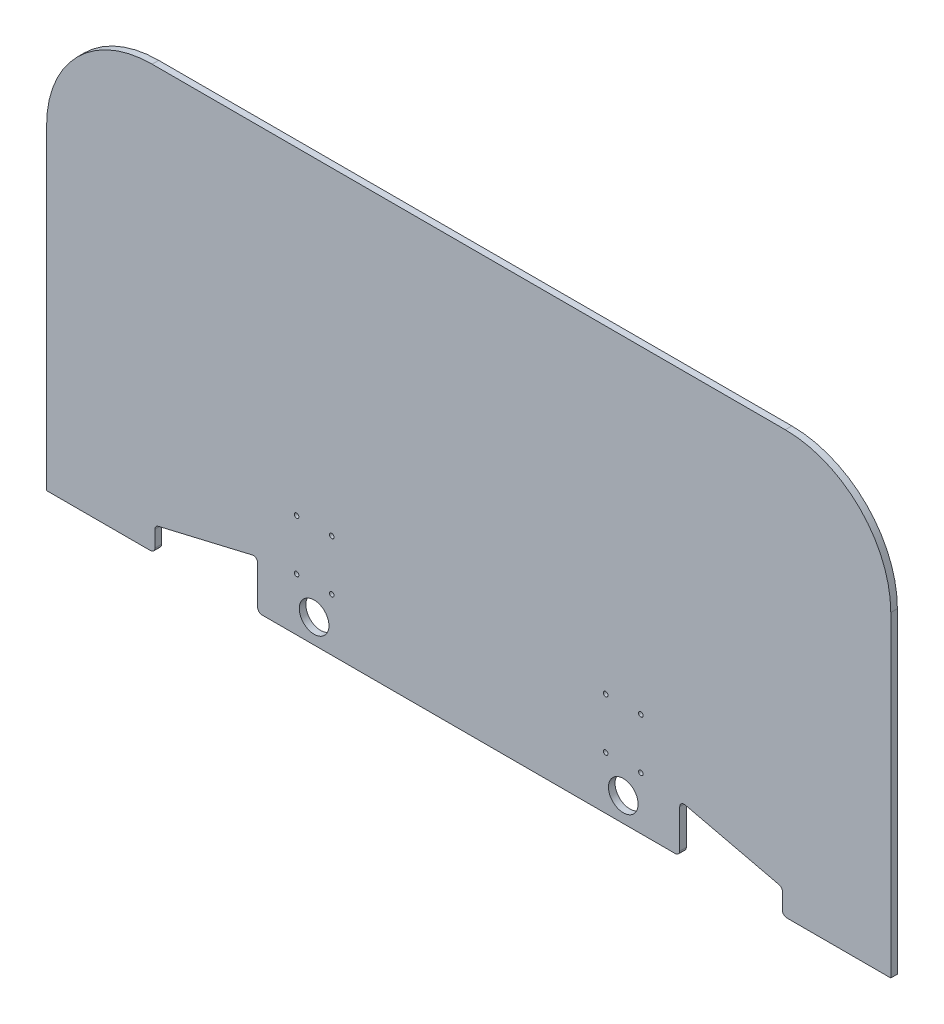
ISO-10303-21;
HEADER;
FILE_DESCRIPTION(('STEP AP214'),'2;1');
FILE_NAME('part.step','',(''),(''),'','','');
FILE_SCHEMA(('AUTOMOTIVE_DESIGN { 1 0 10303 214 1 1 1 1 }'));
ENDSEC;
DATA;
#1=APPLICATION_CONTEXT('core data for automotive mechanical design processes');
#2=APPLICATION_PROTOCOL_DEFINITION('international standard','automotive_design',2000,#1);
#3=PRODUCT_CONTEXT('',#1,'mechanical');
#4=PRODUCT('Part','Part','',(#3));
#5=PRODUCT_RELATED_PRODUCT_CATEGORY('part','',(#4));
#6=PRODUCT_DEFINITION_FORMATION('','',#4);
#7=PRODUCT_DEFINITION_CONTEXT('part definition',#1,'design');
#8=PRODUCT_DEFINITION('design','',#6,#7);
#9=PRODUCT_DEFINITION_SHAPE('','',#8);
#10=(LENGTH_UNIT() NAMED_UNIT(*) SI_UNIT(.MILLI.,.METRE.));
#11=(NAMED_UNIT(*) PLANE_ANGLE_UNIT() SI_UNIT($,.RADIAN.));
#12=(NAMED_UNIT(*) SI_UNIT($,.STERADIAN.) SOLID_ANGLE_UNIT());
#13=UNCERTAINTY_MEASURE_WITH_UNIT(LENGTH_MEASURE(1.E-05),#10,'distance_accuracy_value','');
#14=(GEOMETRIC_REPRESENTATION_CONTEXT(3) GLOBAL_UNCERTAINTY_ASSIGNED_CONTEXT((#13)) GLOBAL_UNIT_ASSIGNED_CONTEXT((#10,
#11,#12)) REPRESENTATION_CONTEXT('',''));
#15=CARTESIAN_POINT('',(0.,0.,0.));
#16=DIRECTION('',(0.,0.,1.));
#17=DIRECTION('',(1.,0.,0.));
#18=AXIS2_PLACEMENT_3D('',#15,#16,#17);
#19=CARTESIAN_POINT('',(0.,0.,4.7625));
#20=DIRECTION('',(0.,0.,1.));
#21=DIRECTION('',(1.,0.,0.));
#22=AXIS2_PLACEMENT_3D('',#19,#20,#21);
#23=PLANE('',#22);
#24=CARTESIAN_POINT('',(197.79996,-155.575,4.7625));
#25=DIRECTION('',(0.,0.,1.));
#26=DIRECTION('',(1.,0.,0.));
#27=AXIS2_PLACEMENT_3D('',#24,#25,#26);
#28=CIRCLE('',#27,3.302);
#29=CARTESIAN_POINT('',(201.10196,-155.575,4.7625));
#30=VERTEX_POINT('',#29);
#31=EDGE_CURVE('E378',#30,#30,#28,.F.);
#32=ORIENTED_EDGE('',*,*,#31,.T.);
#33=EDGE_LOOP('',(#32));
#34=FACE_BOUND('',#33,.T.);
#35=CARTESIAN_POINT('',(248.59996,-155.575,4.7625));
#36=DIRECTION('',(0.,0.,1.));
#37=DIRECTION('',(1.,0.,0.));
#38=AXIS2_PLACEMENT_3D('',#35,#36,#37);
#39=CIRCLE('',#38,3.302);
#40=CARTESIAN_POINT('',(251.90196,-155.575,4.7625));
#41=VERTEX_POINT('',#40);
#42=EDGE_CURVE('E381',#41,#41,#39,.F.);
#43=ORIENTED_EDGE('',*,*,#42,.T.);
#44=EDGE_LOOP('',(#43));
#45=FACE_BOUND('',#44,.T.);
#46=CARTESIAN_POINT('',(197.79996,-228.6,4.7625));
#47=DIRECTION('',(0.,0.,1.));
#48=DIRECTION('',(1.,0.,0.));
#49=AXIS2_PLACEMENT_3D('',#46,#47,#48);
#50=CIRCLE('',#49,3.302);
#51=CARTESIAN_POINT('',(201.10196,-228.6,4.7625));
#52=VERTEX_POINT('',#51);
#53=EDGE_CURVE('E384',#52,#52,#50,.F.);
#54=ORIENTED_EDGE('',*,*,#53,.T.);
#55=EDGE_LOOP('',(#54));
#56=FACE_BOUND('',#55,.T.);
#57=CARTESIAN_POINT('',(248.59996,-228.6,4.7625));
#58=DIRECTION('',(0.,0.,1.));
#59=DIRECTION('',(1.,0.,0.));
#60=AXIS2_PLACEMENT_3D('',#57,#58,#59);
#61=CIRCLE('',#60,3.302);
#62=CARTESIAN_POINT('',(251.90196,-228.6,4.7625));
#63=VERTEX_POINT('',#62);
#64=EDGE_CURVE('E387',#63,#63,#61,.F.);
#65=ORIENTED_EDGE('',*,*,#64,.T.);
#66=EDGE_LOOP('',(#65));
#67=FACE_BOUND('',#66,.T.);
#68=CARTESIAN_POINT('',(-197.79996,-155.575,4.7625));
#69=DIRECTION('',(0.,0.,-1.));
#70=DIRECTION('',(-1.,0.,0.));
#71=AXIS2_PLACEMENT_3D('',#68,#69,#70);
#72=CIRCLE('',#71,3.302);
#73=CARTESIAN_POINT('',(-201.10196,-155.575,4.7625));
#74=VERTEX_POINT('',#73);
#75=EDGE_CURVE('E390',#74,#74,#72,.T.);
#76=ORIENTED_EDGE('',*,*,#75,.T.);
#77=EDGE_LOOP('',(#76));
#78=FACE_BOUND('',#77,.T.);
#79=CARTESIAN_POINT('',(-248.59996,-155.575,4.7625));
#80=DIRECTION('',(0.,0.,-1.));
#81=DIRECTION('',(-1.,0.,0.));
#82=AXIS2_PLACEMENT_3D('',#79,#80,#81);
#83=CIRCLE('',#82,3.302);
#84=CARTESIAN_POINT('',(-251.90196,-155.575,4.7625));
#85=VERTEX_POINT('',#84);
#86=EDGE_CURVE('E393',#85,#85,#83,.T.);
#87=ORIENTED_EDGE('',*,*,#86,.T.);
#88=EDGE_LOOP('',(#87));
#89=FACE_BOUND('',#88,.T.);
#90=CARTESIAN_POINT('',(-197.79996,-228.6,4.7625));
#91=DIRECTION('',(0.,0.,-1.));
#92=DIRECTION('',(-1.,0.,0.));
#93=AXIS2_PLACEMENT_3D('',#90,#91,#92);
#94=CIRCLE('',#93,3.302);
#95=CARTESIAN_POINT('',(-201.10196,-228.6,4.7625));
#96=VERTEX_POINT('',#95);
#97=EDGE_CURVE('E396',#96,#96,#94,.T.);
#98=ORIENTED_EDGE('',*,*,#97,.T.);
#99=EDGE_LOOP('',(#98));
#100=FACE_BOUND('',#99,.T.);
#101=CARTESIAN_POINT('',(-248.59996,-228.6,4.7625));
#102=DIRECTION('',(0.,0.,-1.));
#103=DIRECTION('',(-1.,0.,0.));
#104=AXIS2_PLACEMENT_3D('',#101,#102,#103);
#105=CIRCLE('',#104,3.302);
#106=CARTESIAN_POINT('',(-251.90196,-228.6,4.7625));
#107=VERTEX_POINT('',#106);
#108=EDGE_CURVE('E399',#107,#107,#105,.T.);
#109=ORIENTED_EDGE('',*,*,#108,.T.);
#110=EDGE_LOOP('',(#109));
#111=FACE_BOUND('',#110,.T.);
#112=CARTESIAN_POINT('',(-223.266,-269.875,4.7625));
#113=DIRECTION('',(0.,0.,-1.));
#114=DIRECTION('',(-1.,0.,0.));
#115=AXIS2_PLACEMENT_3D('',#112,#113,#114);
#116=CIRCLE('',#115,21.43125);
#117=CARTESIAN_POINT('',(-244.69725,-269.875,4.7625));
#118=VERTEX_POINT('',#117);
#119=EDGE_CURVE('E402',#118,#118,#116,.T.);
#120=ORIENTED_EDGE('',*,*,#119,.T.);
#121=EDGE_LOOP('',(#120));
#122=FACE_BOUND('',#121,.T.);
#123=CARTESIAN_POINT('',(223.266,-269.875,4.7625));
#124=DIRECTION('',(0.,0.,-1.));
#125=DIRECTION('',(-1.,0.,0.));
#126=AXIS2_PLACEMENT_3D('',#123,#124,#125);
#127=CIRCLE('',#126,21.43125);
#128=CARTESIAN_POINT('',(201.83475,-269.875,4.7625));
#129=VERTEX_POINT('',#128);
#130=EDGE_CURVE('E248',#129,#129,#127,.T.);
#131=ORIENTED_EDGE('',*,*,#130,.T.);
#132=EDGE_LOOP('',(#131));
#133=FACE_BOUND('',#132,.T.);
#134=DIRECTION('',(1.,0.,0.));
#135=VECTOR('',#134,1.);
#136=CARTESIAN_POINT('',(609.6,304.8,4.7625));
#137=LINE('',#136,#135);
#138=CARTESIAN_POINT('',(-457.2,304.8,4.7625));
#139=VERTEX_POINT('',#138);
#140=CARTESIAN_POINT('',(457.2,304.8,4.7625));
#141=VERTEX_POINT('',#140);
#142=EDGE_CURVE('E245',#139,#141,#137,.T.);
#143=ORIENTED_EDGE('',*,*,#142,.F.);
#144=CARTESIAN_POINT('',(-457.2,152.4,4.7625));
#145=DIRECTION('',(0.,0.,-1.));
#146=DIRECTION('',(-1.,0.,0.));
#147=AXIS2_PLACEMENT_3D('',#144,#145,#146);
#148=CIRCLE('',#147,152.4);
#149=CARTESIAN_POINT('',(-609.6,152.4,4.7625));
#150=VERTEX_POINT('',#149);
#151=EDGE_CURVE('E20',#150,#139,#148,.T.);
#152=ORIENTED_EDGE('',*,*,#151,.F.);
#153=DIRECTION('',(0.,1.,0.));
#154=VECTOR('',#153,1.);
#155=CARTESIAN_POINT('',(-609.6,304.8,4.7625));
#156=LINE('',#155,#154);
#157=CARTESIAN_POINT('',(-609.6,-304.8,4.7625));
#158=VERTEX_POINT('',#157);
#159=EDGE_CURVE('E156',#158,#150,#156,.T.);
#160=ORIENTED_EDGE('',*,*,#159,.F.);
#161=DIRECTION('',(1.,0.,0.));
#162=VECTOR('',#161,1.);
#163=CARTESIAN_POINT('',(-609.6,-304.8,4.7625));
#164=LINE('',#163,#162);
#165=CARTESIAN_POINT('',(-459.494209104994,-304.8,4.7625));
#166=VERTEX_POINT('',#165);
#167=EDGE_CURVE('E162',#166,#158,#164,.F.);
#168=ORIENTED_EDGE('',*,*,#167,.F.);
#169=CARTESIAN_POINT('',(-459.494209104994,-298.45,4.7625));
#170=DIRECTION('',(0.,0.,1.));
#171=DIRECTION('',(1.,0.,0.));
#172=AXIS2_PLACEMENT_3D('',#169,#170,#171);
#173=CIRCLE('',#172,6.35);
#174=CARTESIAN_POINT('',(-453.144209104994,-298.45,4.7625));
#175=VERTEX_POINT('',#174);
#176=EDGE_CURVE('E304',#175,#166,#173,.F.);
#177=ORIENTED_EDGE('',*,*,#176,.F.);
#178=DIRECTION('',(0.,1.,0.));
#179=VECTOR('',#178,1.);
#180=CARTESIAN_POINT('',(-453.144209104994,-269.875,4.7625));
#181=LINE('',#180,#179);
#182=CARTESIAN_POINT('',(-453.144209104994,-274.903617257706,4.7625));
#183=VERTEX_POINT('',#182);
#184=EDGE_CURVE('E300',#175,#183,#181,.T.);
#185=ORIENTED_EDGE('',*,*,#184,.T.);
#186=CARTESIAN_POINT('',(-446.794209104994,-274.903617257706,4.7625));
#187=DIRECTION('',(0.,0.,-1.));
#188=DIRECTION('',(-1.,0.,0.));
#189=AXIS2_PLACEMENT_3D('',#186,#187,#188);
#190=CIRCLE('',#189,6.35);
#191=CARTESIAN_POINT('',(-448.249417438357,-268.722608545088,4.7625));
#192=VERTEX_POINT('',#191);
#193=EDGE_CURVE('E296',#183,#192,#190,.T.);
#194=ORIENTED_EDGE('',*,*,#193,.T.);
#195=DIRECTION('',(-0.973387198851966,-0.229166666666692,0.));
#196=VECTOR('',#195,1.);
#197=CARTESIAN_POINT('',(-304.8,-234.95,4.7625));
#198=LINE('',#197,#196);
#199=CARTESIAN_POINT('',(-312.605208333375,-236.787597184874,4.7625));
#200=VERTEX_POINT('',#199);
#201=EDGE_CURVE('E292',#192,#200,#198,.F.);
#202=ORIENTED_EDGE('',*,*,#201,.T.);
#203=CARTESIAN_POINT('',(-311.15,-242.96860589758,4.7625));
#204=DIRECTION('',(0.,0.,-1.));
#205=DIRECTION('',(-1.,0.,0.));
#206=AXIS2_PLACEMENT_3D('',#203,#204,#205);
#207=CIRCLE('',#206,6.35);
#208=CARTESIAN_POINT('',(-304.8,-242.96860589758,4.7625));
#209=VERTEX_POINT('',#208);
#210=EDGE_CURVE('E288',#200,#209,#207,.T.);
#211=ORIENTED_EDGE('',*,*,#210,.T.);
#212=DIRECTION('',(0.,1.,0.));
#213=VECTOR('',#212,1.);
#214=CARTESIAN_POINT('',(-304.8,-304.8,4.7625));
#215=LINE('',#214,#213);
#216=CARTESIAN_POINT('',(-304.8,-298.45,4.7625));
#217=VERTEX_POINT('',#216);
#218=EDGE_CURVE('E287',#209,#217,#215,.F.);
#219=ORIENTED_EDGE('',*,*,#218,.T.);
#220=CARTESIAN_POINT('',(-298.45,-298.45,4.7625));
#221=DIRECTION('',(0.,0.,-1.));
#222=DIRECTION('',(-1.,0.,0.));
#223=AXIS2_PLACEMENT_3D('',#220,#221,#222);
#224=CIRCLE('',#223,6.35);
#225=CARTESIAN_POINT('',(-298.45,-304.8,4.7625));
#226=VERTEX_POINT('',#225);
#227=EDGE_CURVE('E283',#226,#217,#224,.T.);
#228=ORIENTED_EDGE('',*,*,#227,.F.);
#229=DIRECTION('',(1.,0.,0.));
#230=VECTOR('',#229,1.);
#231=CARTESIAN_POINT('',(-609.6,-304.8,4.7625));
#232=LINE('',#231,#230);
#233=CARTESIAN_POINT('',(298.45,-304.8,4.7625));
#234=VERTEX_POINT('',#233);
#235=EDGE_CURVE('E280',#234,#226,#232,.F.);
#236=ORIENTED_EDGE('',*,*,#235,.F.);
#237=CARTESIAN_POINT('',(298.45,-298.45,4.7625));
#238=DIRECTION('',(0.,0.,1.));
#239=DIRECTION('',(1.,0.,0.));
#240=AXIS2_PLACEMENT_3D('',#237,#238,#239);
#241=CIRCLE('',#240,6.35);
#242=CARTESIAN_POINT('',(304.8,-298.45,4.7625));
#243=VERTEX_POINT('',#242);
#244=EDGE_CURVE('E277',#243,#234,#241,.F.);
#245=ORIENTED_EDGE('',*,*,#244,.F.);
#246=DIRECTION('',(0.,1.,0.));
#247=VECTOR('',#246,1.);
#248=CARTESIAN_POINT('',(304.8,-304.8,4.7625));
#249=LINE('',#248,#247);
#250=CARTESIAN_POINT('',(304.8,-242.96860589758,4.7625));
#251=VERTEX_POINT('',#250);
#252=EDGE_CURVE('E274',#251,#243,#249,.F.);
#253=ORIENTED_EDGE('',*,*,#252,.F.);
#254=CARTESIAN_POINT('',(311.15,-242.96860589758,4.7625));
#255=DIRECTION('',(0.,0.,1.));
#256=DIRECTION('',(1.,0.,0.));
#257=AXIS2_PLACEMENT_3D('',#254,#255,#256);
#258=CIRCLE('',#257,6.35);
#259=CARTESIAN_POINT('',(312.605208333376,-236.78759718487,4.7625));
#260=VERTEX_POINT('',#259);
#261=EDGE_CURVE('E271',#251,#260,#258,.F.);
#262=ORIENTED_EDGE('',*,*,#261,.T.);
#263=DIRECTION('',(0.973387198851966,-0.229166666666692,0.));
#264=VECTOR('',#263,1.);
#265=CARTESIAN_POINT('',(304.8,-234.95,4.7625));
#266=LINE('',#265,#264);
#267=CARTESIAN_POINT('',(448.249417438366,-268.722608545048,4.7625));
#268=VERTEX_POINT('',#267);
#269=EDGE_CURVE('E267',#268,#260,#266,.F.);
#270=ORIENTED_EDGE('',*,*,#269,.F.);
#271=CARTESIAN_POINT('',(446.794209104994,-274.903617257706,4.7625));
#272=DIRECTION('',(0.,0.,1.));
#273=DIRECTION('',(1.,0.,0.));
#274=AXIS2_PLACEMENT_3D('',#271,#272,#273);
#275=CIRCLE('',#274,6.35);
#276=CARTESIAN_POINT('',(453.144209104994,-274.903617257706,4.7625));
#277=VERTEX_POINT('',#276);
#278=EDGE_CURVE('E264',#268,#277,#275,.F.);
#279=ORIENTED_EDGE('',*,*,#278,.T.);
#280=DIRECTION('',(0.,1.,0.));
#281=VECTOR('',#280,1.);
#282=CARTESIAN_POINT('',(453.144209104994,-269.875,4.7625));
#283=LINE('',#282,#281);
#284=CARTESIAN_POINT('',(453.144209104994,-298.45,4.7625));
#285=VERTEX_POINT('',#284);
#286=EDGE_CURVE('E260',#285,#277,#283,.T.);
#287=ORIENTED_EDGE('',*,*,#286,.F.);
#288=CARTESIAN_POINT('',(459.494209104994,-298.45,4.7625));
#289=DIRECTION('',(0.,0.,-1.));
#290=DIRECTION('',(-1.,0.,0.));
#291=AXIS2_PLACEMENT_3D('',#288,#289,#290);
#292=CIRCLE('',#291,6.35);
#293=CARTESIAN_POINT('',(459.494209104994,-304.8,4.7625));
#294=VERTEX_POINT('',#293);
#295=EDGE_CURVE('E257',#294,#285,#292,.T.);
#296=ORIENTED_EDGE('',*,*,#295,.F.);
#297=DIRECTION('',(1.,0.,0.));
#298=VECTOR('',#297,1.);
#299=CARTESIAN_POINT('',(-609.6,-304.8,4.7625));
#300=LINE('',#299,#298);
#301=CARTESIAN_POINT('',(609.6,-304.8,4.7625));
#302=VERTEX_POINT('',#301);
#303=EDGE_CURVE('E254',#302,#294,#300,.F.);
#304=ORIENTED_EDGE('',*,*,#303,.F.);
#305=DIRECTION('',(0.,1.,0.));
#306=VECTOR('',#305,1.);
#307=CARTESIAN_POINT('',(609.6,-304.8,4.7625));
#308=LINE('',#307,#306);
#309=CARTESIAN_POINT('',(609.6,152.4,4.7625));
#310=VERTEX_POINT('',#309);
#311=EDGE_CURVE('E177',#310,#302,#308,.F.);
#312=ORIENTED_EDGE('',*,*,#311,.F.);
#313=CARTESIAN_POINT('',(457.2,152.4,4.7625));
#314=DIRECTION('',(0.,0.,-1.));
#315=DIRECTION('',(-1.,0.,0.));
#316=AXIS2_PLACEMENT_3D('',#313,#314,#315);
#317=CIRCLE('',#316,152.4);
#318=EDGE_CURVE('E181',#141,#310,#317,.T.);
#319=ORIENTED_EDGE('',*,*,#318,.F.);
#320=EDGE_LOOP('',(#143,#152,#160,#168,#177,#185,#194,#202,#211,#219,#228,#236,#245,#253,#262,
#270,#279,#287,#296,#304,#312,#319));
#321=FACE_BOUND('',#320,.T.);
#322=ADVANCED_FACE('F17',(#34,#45,#56,#67,#78,#89,#100,#111,#122,#133,#321),#23,.T.);
#323=CARTESIAN_POINT('',(-457.2,152.4,188.97219));
#324=DIRECTION('',(0.,0.,-1.));
#325=DIRECTION('',(-1.,0.,0.));
#326=AXIS2_PLACEMENT_3D('',#323,#324,#325);
#327=CYLINDRICAL_SURFACE('',#326,152.4);
#328=DIRECTION('',(0.,0.,1.));
#329=VECTOR('',#328,1.);
#330=CARTESIAN_POINT('',(-457.2,304.8,-4.7625));
#331=LINE('',#330,#329);
#332=CARTESIAN_POINT('',(-457.2,304.8,-4.7625));
#333=VERTEX_POINT('',#332);
#334=EDGE_CURVE('E244',#333,#139,#331,.T.);
#335=ORIENTED_EDGE('',*,*,#334,.F.);
#336=CARTESIAN_POINT('',(-457.2,152.4,-4.7625));
#337=DIRECTION('',(0.,0.,-1.));
#338=DIRECTION('',(-1.,0.,0.));
#339=AXIS2_PLACEMENT_3D('',#336,#337,#338);
#340=CIRCLE('',#339,152.4);
#341=CARTESIAN_POINT('',(-609.6,152.4,-4.7625));
#342=VERTEX_POINT('',#341);
#343=EDGE_CURVE('E240',#333,#342,#340,.F.);
#344=ORIENTED_EDGE('',*,*,#343,.T.);
#345=DIRECTION('',(0.,0.,1.));
#346=VECTOR('',#345,1.);
#347=CARTESIAN_POINT('',(-609.6,152.4,-4.7625));
#348=LINE('',#347,#346);
#349=EDGE_CURVE('E311',#150,#342,#348,.F.);
#350=ORIENTED_EDGE('',*,*,#349,.F.);
#351=ORIENTED_EDGE('',*,*,#151,.T.);
#352=EDGE_LOOP('',(#335,#344,#350,#351));
#353=FACE_BOUND('',#352,.T.);
#354=ADVANCED_FACE('F432',(#353),#327,.T.);
#355=CARTESIAN_POINT('',(-609.6,304.8,-4.7625));
#356=DIRECTION('',(-1.,0.,0.));
#357=DIRECTION('',(0.,0.,1.));
#358=AXIS2_PLACEMENT_3D('',#355,#356,#357);
#359=PLANE('',#358);
#360=ORIENTED_EDGE('',*,*,#159,.T.);
#361=ORIENTED_EDGE('',*,*,#349,.T.);
#362=DIRECTION('',(0.,1.,0.));
#363=VECTOR('',#362,1.);
#364=CARTESIAN_POINT('',(-609.6,0.,-4.7625));
#365=LINE('',#364,#363);
#366=CARTESIAN_POINT('',(-609.6,-304.8,-4.7625));
#367=VERTEX_POINT('',#366);
#368=EDGE_CURVE('E235',#342,#367,#365,.F.);
#369=ORIENTED_EDGE('',*,*,#368,.T.);
#370=DIRECTION('',(0.,0.,-1.));
#371=VECTOR('',#370,1.);
#372=CARTESIAN_POINT('',(-609.6,-304.8,-4.7625));
#373=LINE('',#372,#371);
#374=EDGE_CURVE('E307',#158,#367,#373,.T.);
#375=ORIENTED_EDGE('',*,*,#374,.F.);
#376=EDGE_LOOP('',(#360,#361,#369,#375));
#377=FACE_BOUND('',#376,.T.);
#378=ADVANCED_FACE('F427',(#377),#359,.T.);
#379=CARTESIAN_POINT('',(-609.6,-304.8,-4.7625));
#380=DIRECTION('',(0.,-1.,0.));
#381=DIRECTION('',(0.,0.,-1.));
#382=AXIS2_PLACEMENT_3D('',#379,#380,#381);
#383=PLANE('',#382);
#384=DIRECTION('',(1.,0.,0.));
#385=VECTOR('',#384,1.);
#386=CARTESIAN_POINT('',(0.,-304.8,-4.7625));
#387=LINE('',#386,#385);
#388=CARTESIAN_POINT('',(-459.494209104994,-304.8,-4.7625));
#389=VERTEX_POINT('',#388);
#390=EDGE_CURVE('E232',#367,#389,#387,.T.);
#391=ORIENTED_EDGE('',*,*,#390,.T.);
#392=DIRECTION('',(0.,0.,1.));
#393=VECTOR('',#392,1.);
#394=CARTESIAN_POINT('',(-459.494209104994,-304.8,-17.17929));
#395=LINE('',#394,#393);
#396=EDGE_CURVE('E305',#166,#389,#395,.F.);
#397=ORIENTED_EDGE('',*,*,#396,.F.);
#398=ORIENTED_EDGE('',*,*,#167,.T.);
#399=ORIENTED_EDGE('',*,*,#374,.T.);
#400=EDGE_LOOP('',(#391,#397,#398,#399));
#401=FACE_BOUND('',#400,.T.);
#402=ADVANCED_FACE('F423',(#401),#383,.T.);
#403=CARTESIAN_POINT('',(-459.494209104994,-298.45,-17.17929));
#404=DIRECTION('',(0.,0.,1.));
#405=DIRECTION('',(1.,0.,0.));
#406=AXIS2_PLACEMENT_3D('',#403,#404,#405);
#407=CYLINDRICAL_SURFACE('',#406,6.35);
#408=DIRECTION('',(0.,0.,1.));
#409=VECTOR('',#408,1.);
#410=CARTESIAN_POINT('',(-453.144209104994,-298.45,4.7625));
#411=LINE('',#410,#409);
#412=CARTESIAN_POINT('',(-453.144209104994,-298.45,-4.7625));
#413=VERTEX_POINT('',#412);
#414=EDGE_CURVE('E301',#413,#175,#411,.T.);
#415=ORIENTED_EDGE('',*,*,#414,.T.);
#416=ORIENTED_EDGE('',*,*,#176,.T.);
#417=ORIENTED_EDGE('',*,*,#396,.T.);
#418=CARTESIAN_POINT('',(-459.494209104994,-298.45,-4.7625));
#419=DIRECTION('',(0.,0.,1.));
#420=DIRECTION('',(1.,0.,0.));
#421=AXIS2_PLACEMENT_3D('',#418,#419,#420);
#422=CIRCLE('',#421,6.35);
#423=EDGE_CURVE('E231',#389,#413,#422,.T.);
#424=ORIENTED_EDGE('',*,*,#423,.T.);
#425=EDGE_LOOP('',(#415,#416,#417,#424));
#426=FACE_BOUND('',#425,.T.);
#427=ADVANCED_FACE('F419',(#426),#407,.T.);
#428=CARTESIAN_POINT('',(-453.144209104994,-269.875,4.7625));
#429=DIRECTION('',(-1.,0.,0.));
#430=DIRECTION('',(0.,0.,1.));
#431=AXIS2_PLACEMENT_3D('',#428,#429,#430);
#432=PLANE('',#431);
#433=DIRECTION('',(0.,0.,-1.));
#434=VECTOR('',#433,1.);
#435=CARTESIAN_POINT('',(-453.144209104994,-274.903617257706,17.17929));
#436=LINE('',#435,#434);
#437=CARTESIAN_POINT('',(-453.144209104994,-274.903617257706,-4.7625));
#438=VERTEX_POINT('',#437);
#439=EDGE_CURVE('E297',#438,#183,#436,.F.);
#440=ORIENTED_EDGE('',*,*,#439,.T.);
#441=ORIENTED_EDGE('',*,*,#184,.F.);
#442=ORIENTED_EDGE('',*,*,#414,.F.);
#443=DIRECTION('',(0.,1.,0.));
#444=VECTOR('',#443,1.);
#445=CARTESIAN_POINT('',(-453.144209104994,0.,-4.7625));
#446=LINE('',#445,#444);
#447=EDGE_CURVE('E228',#413,#438,#446,.T.);
#448=ORIENTED_EDGE('',*,*,#447,.T.);
#449=EDGE_LOOP('',(#440,#441,#442,#448));
#450=FACE_BOUND('',#449,.T.);
#451=ADVANCED_FACE('F494',(#450),#432,.F.);
#452=CARTESIAN_POINT('',(-446.794209104994,-274.903617257706,17.17929));
#453=DIRECTION('',(0.,0.,-1.));
#454=DIRECTION('',(-1.,0.,0.));
#455=AXIS2_PLACEMENT_3D('',#452,#453,#454);
#456=CYLINDRICAL_SURFACE('',#455,6.35);
#457=DIRECTION('',(0.,0.,1.));
#458=VECTOR('',#457,1.);
#459=CARTESIAN_POINT('',(-448.249417438406,-268.722608545099,4.7625));
#460=LINE('',#459,#458);
#461=CARTESIAN_POINT('',(-448.24941743836,-268.722608545074,-4.7625));
#462=VERTEX_POINT('',#461);
#463=EDGE_CURVE('E293',#462,#192,#460,.T.);
#464=ORIENTED_EDGE('',*,*,#463,.T.);
#465=ORIENTED_EDGE('',*,*,#193,.F.);
#466=ORIENTED_EDGE('',*,*,#439,.F.);
#467=CARTESIAN_POINT('',(-446.794209104994,-274.903617257706,-4.7625));
#468=DIRECTION('',(0.,0.,-1.));
#469=DIRECTION('',(-1.,0.,0.));
#470=AXIS2_PLACEMENT_3D('',#467,#468,#469);
#471=CIRCLE('',#470,6.35);
#472=EDGE_CURVE('E227',#438,#462,#471,.T.);
#473=ORIENTED_EDGE('',*,*,#472,.T.);
#474=EDGE_LOOP('',(#464,#465,#466,#473));
#475=FACE_BOUND('',#474,.T.);
#476=ADVANCED_FACE('F492',(#475),#456,.F.);
#477=CARTESIAN_POINT('',(-304.8,-234.95,4.7625));
#478=DIRECTION('',(-0.229166666666692,0.973387198851966,0.));
#479=DIRECTION('',(-0.973387198851966,-0.229166666666692,0.));
#480=AXIS2_PLACEMENT_3D('',#477,#478,#479);
#481=PLANE('',#480);
#482=ORIENTED_EDGE('',*,*,#463,.F.);
#483=DIRECTION('',(0.973387198851996,0.229166666666567,0.));
#484=VECTOR('',#483,1.);
#485=CARTESIAN_POINT('',(-448.249417438412,-268.722608545072,-4.7625));
#486=LINE('',#485,#484);
#487=CARTESIAN_POINT('',(-312.605208333375,-236.787597184869,-4.7625));
#488=VERTEX_POINT('',#487);
#489=EDGE_CURVE('E224',#462,#488,#486,.T.);
#490=ORIENTED_EDGE('',*,*,#489,.T.);
#491=DIRECTION('',(0.,0.,-1.));
#492=VECTOR('',#491,1.);
#493=CARTESIAN_POINT('',(-312.605208333413,-236.787597184888,17.17929));
#494=LINE('',#493,#492);
#495=EDGE_CURVE('E289',#488,#200,#494,.F.);
#496=ORIENTED_EDGE('',*,*,#495,.T.);
#497=ORIENTED_EDGE('',*,*,#201,.F.);
#498=EDGE_LOOP('',(#482,#490,#496,#497));
#499=FACE_BOUND('',#498,.T.);
#500=ADVANCED_FACE('F488',(#499),#481,.F.);
#501=CARTESIAN_POINT('',(-311.15,-242.96860589758,17.17929));
#502=DIRECTION('',(0.,0.,-1.));
#503=DIRECTION('',(-1.,0.,0.));
#504=AXIS2_PLACEMENT_3D('',#501,#502,#503);
#505=CYLINDRICAL_SURFACE('',#504,6.35);
#506=DIRECTION('',(0.,0.,-1.));
#507=VECTOR('',#506,1.);
#508=CARTESIAN_POINT('',(-304.8,-242.96860589758,4.7625));
#509=LINE('',#508,#507);
#510=CARTESIAN_POINT('',(-304.8,-242.96860589758,-4.7625));
#511=VERTEX_POINT('',#510);
#512=EDGE_CURVE('E284',#511,#209,#509,.F.);
#513=ORIENTED_EDGE('',*,*,#512,.T.);
#514=ORIENTED_EDGE('',*,*,#210,.F.);
#515=ORIENTED_EDGE('',*,*,#495,.F.);
#516=CARTESIAN_POINT('',(-311.15,-242.96860589758,-4.7625));
#517=DIRECTION('',(0.,0.,-1.));
#518=DIRECTION('',(-1.,0.,0.));
#519=AXIS2_PLACEMENT_3D('',#516,#517,#518);
#520=CIRCLE('',#519,6.35);
#521=EDGE_CURVE('E223',#488,#511,#520,.T.);
#522=ORIENTED_EDGE('',*,*,#521,.T.);
#523=EDGE_LOOP('',(#513,#514,#515,#522));
#524=FACE_BOUND('',#523,.T.);
#525=ADVANCED_FACE('F484',(#524),#505,.F.);
#526=CARTESIAN_POINT('',(-304.8,-304.8,4.7625));
#527=DIRECTION('',(1.,0.,0.));
#528=DIRECTION('',(0.,0.,-1.));
#529=AXIS2_PLACEMENT_3D('',#526,#527,#528);
#530=PLANE('',#529);
#531=ORIENTED_EDGE('',*,*,#512,.F.);
#532=DIRECTION('',(0.,1.,0.));
#533=VECTOR('',#532,1.);
#534=CARTESIAN_POINT('',(-304.8,0.,-4.7625));
#535=LINE('',#534,#533);
#536=CARTESIAN_POINT('',(-304.8,-298.45,-4.7625));
#537=VERTEX_POINT('',#536);
#538=EDGE_CURVE('E220',#511,#537,#535,.F.);
#539=ORIENTED_EDGE('',*,*,#538,.T.);
#540=DIRECTION('',(0.,0.,-1.));
#541=VECTOR('',#540,1.);
#542=CARTESIAN_POINT('',(-304.8,-298.45,17.17929));
#543=LINE('',#542,#541);
#544=EDGE_CURVE('E281',#217,#537,#543,.T.);
#545=ORIENTED_EDGE('',*,*,#544,.F.);
#546=ORIENTED_EDGE('',*,*,#218,.F.);
#547=EDGE_LOOP('',(#531,#539,#545,#546));
#548=FACE_BOUND('',#547,.T.);
#549=ADVANCED_FACE('F480',(#548),#530,.F.);
#550=CARTESIAN_POINT('',(-298.45,-298.45,17.17929));
#551=DIRECTION('',(0.,0.,-1.));
#552=DIRECTION('',(-1.,0.,0.));
#553=AXIS2_PLACEMENT_3D('',#550,#551,#552);
#554=CYLINDRICAL_SURFACE('',#553,6.35);
#555=ORIENTED_EDGE('',*,*,#544,.T.);
#556=CARTESIAN_POINT('',(-298.45,-298.45,-4.7625));
#557=DIRECTION('',(0.,0.,-1.));
#558=DIRECTION('',(-1.,0.,0.));
#559=AXIS2_PLACEMENT_3D('',#556,#557,#558);
#560=CIRCLE('',#559,6.35);
#561=CARTESIAN_POINT('',(-298.45,-304.8,-4.7625));
#562=VERTEX_POINT('',#561);
#563=EDGE_CURVE('E219',#537,#562,#560,.F.);
#564=ORIENTED_EDGE('',*,*,#563,.T.);
#565=DIRECTION('',(0.,0.,-1.));
#566=VECTOR('',#565,1.);
#567=CARTESIAN_POINT('',(-298.45,-304.8,-4.7625));
#568=LINE('',#567,#566);
#569=EDGE_CURVE('E278',#226,#562,#568,.T.);
#570=ORIENTED_EDGE('',*,*,#569,.F.);
#571=ORIENTED_EDGE('',*,*,#227,.T.);
#572=EDGE_LOOP('',(#555,#564,#570,#571));
#573=FACE_BOUND('',#572,.T.);
#574=ADVANCED_FACE('F475',(#573),#554,.T.);
#575=CARTESIAN_POINT('',(-609.6,-304.8,-4.7625));
#576=DIRECTION('',(0.,-1.,0.));
#577=DIRECTION('',(0.,0.,-1.));
#578=AXIS2_PLACEMENT_3D('',#575,#576,#577);
#579=PLANE('',#578);
#580=DIRECTION('',(1.,0.,0.));
#581=VECTOR('',#580,1.);
#582=CARTESIAN_POINT('',(0.,-304.8,-4.7625));
#583=LINE('',#582,#581);
#584=CARTESIAN_POINT('',(298.45,-304.8,-4.7625));
#585=VERTEX_POINT('',#584);
#586=EDGE_CURVE('E216',#562,#585,#583,.T.);
#587=ORIENTED_EDGE('',*,*,#586,.T.);
#588=DIRECTION('',(0.,0.,1.));
#589=VECTOR('',#588,1.);
#590=CARTESIAN_POINT('',(298.45,-304.8,-17.17929));
#591=LINE('',#590,#589);
#592=EDGE_CURVE('E275',#234,#585,#591,.F.);
#593=ORIENTED_EDGE('',*,*,#592,.F.);
#594=ORIENTED_EDGE('',*,*,#235,.T.);
#595=ORIENTED_EDGE('',*,*,#569,.T.);
#596=EDGE_LOOP('',(#587,#593,#594,#595));
#597=FACE_BOUND('',#596,.T.);
#598=ADVANCED_FACE('F471',(#597),#579,.T.);
#599=CARTESIAN_POINT('',(298.45,-298.45,-17.17929));
#600=DIRECTION('',(0.,0.,1.));
#601=DIRECTION('',(1.,0.,0.));
#602=AXIS2_PLACEMENT_3D('',#599,#600,#601);
#603=CYLINDRICAL_SURFACE('',#602,6.35);
#604=DIRECTION('',(0.,0.,-1.));
#605=VECTOR('',#604,1.);
#606=CARTESIAN_POINT('',(304.8,-298.45,4.7625));
#607=LINE('',#606,#605);
#608=CARTESIAN_POINT('',(304.8,-298.45,-4.7625));
#609=VERTEX_POINT('',#608);
#610=EDGE_CURVE('E272',#243,#609,#607,.T.);
#611=ORIENTED_EDGE('',*,*,#610,.F.);
#612=ORIENTED_EDGE('',*,*,#244,.T.);
#613=ORIENTED_EDGE('',*,*,#592,.T.);
#614=CARTESIAN_POINT('',(298.45,-298.45,-4.7625));
#615=DIRECTION('',(0.,0.,1.));
#616=DIRECTION('',(1.,0.,0.));
#617=AXIS2_PLACEMENT_3D('',#614,#615,#616);
#618=CIRCLE('',#617,6.35);
#619=EDGE_CURVE('E215',#585,#609,#618,.T.);
#620=ORIENTED_EDGE('',*,*,#619,.T.);
#621=EDGE_LOOP('',(#611,#612,#613,#620));
#622=FACE_BOUND('',#621,.T.);
#623=ADVANCED_FACE('F466',(#622),#603,.T.);
#624=CARTESIAN_POINT('',(304.8,-304.8,4.7625));
#625=DIRECTION('',(1.,0.,0.));
#626=DIRECTION('',(0.,0.,-1.));
#627=AXIS2_PLACEMENT_3D('',#624,#625,#626);
#628=PLANE('',#627);
#629=ORIENTED_EDGE('',*,*,#252,.T.);
#630=ORIENTED_EDGE('',*,*,#610,.T.);
#631=DIRECTION('',(0.,1.,0.));
#632=VECTOR('',#631,1.);
#633=CARTESIAN_POINT('',(304.8,0.,-4.7625));
#634=LINE('',#633,#632);
#635=CARTESIAN_POINT('',(304.8,-242.96860589758,-4.7625));
#636=VERTEX_POINT('',#635);
#637=EDGE_CURVE('E212',#609,#636,#634,.T.);
#638=ORIENTED_EDGE('',*,*,#637,.T.);
#639=DIRECTION('',(0.,0.,1.));
#640=VECTOR('',#639,1.);
#641=CARTESIAN_POINT('',(304.8,-242.96860589758,-17.17929));
#642=LINE('',#641,#640);
#643=EDGE_CURVE('E268',#636,#251,#642,.T.);
#644=ORIENTED_EDGE('',*,*,#643,.T.);
#645=EDGE_LOOP('',(#629,#630,#638,#644));
#646=FACE_BOUND('',#645,.T.);
#647=ADVANCED_FACE('F462',(#646),#628,.T.);
#648=CARTESIAN_POINT('',(311.15,-242.96860589758,-17.17929));
#649=DIRECTION('',(0.,0.,1.));
#650=DIRECTION('',(1.,0.,0.));
#651=AXIS2_PLACEMENT_3D('',#648,#649,#650);
#652=CYLINDRICAL_SURFACE('',#651,6.35);
#653=ORIENTED_EDGE('',*,*,#643,.F.);
#654=CARTESIAN_POINT('',(311.15,-242.96860589758,-4.7625));
#655=DIRECTION('',(0.,0.,1.));
#656=DIRECTION('',(1.,0.,0.));
#657=AXIS2_PLACEMENT_3D('',#654,#655,#656);
#658=CIRCLE('',#657,6.35);
#659=CARTESIAN_POINT('',(312.605208333376,-236.787597184865,-4.7625));
#660=VERTEX_POINT('',#659);
#661=EDGE_CURVE('E211',#636,#660,#658,.F.);
#662=ORIENTED_EDGE('',*,*,#661,.T.);
#663=DIRECTION('',(0.,0.,1.));
#664=VECTOR('',#663,1.);
#665=CARTESIAN_POINT('',(312.605208333416,-236.787597184879,4.7625));
#666=LINE('',#665,#664);
#667=EDGE_CURVE('E265',#260,#660,#666,.F.);
#668=ORIENTED_EDGE('',*,*,#667,.F.);
#669=ORIENTED_EDGE('',*,*,#261,.F.);
#670=EDGE_LOOP('',(#653,#662,#668,#669));
#671=FACE_BOUND('',#670,.T.);
#672=ADVANCED_FACE('F458',(#671),#652,.F.);
#673=CARTESIAN_POINT('',(304.8,-234.95,4.7625));
#674=DIRECTION('',(-0.229166666666692,-0.973387198851966,0.));
#675=DIRECTION('',(0.973387198851966,-0.229166666666692,0.));
#676=AXIS2_PLACEMENT_3D('',#673,#674,#675);
#677=PLANE('',#676);
#678=ORIENTED_EDGE('',*,*,#269,.T.);
#679=ORIENTED_EDGE('',*,*,#667,.T.);
#680=DIRECTION('',(0.973387198851996,-0.229166666666567,0.));
#681=VECTOR('',#680,1.);
#682=CARTESIAN_POINT('',(312.605208333418,-236.787597184869,-4.7625));
#683=LINE('',#682,#681);
#684=CARTESIAN_POINT('',(448.249417438369,-268.722608545034,-4.7625));
#685=VERTEX_POINT('',#684);
#686=EDGE_CURVE('E208',#660,#685,#683,.T.);
#687=ORIENTED_EDGE('',*,*,#686,.T.);
#688=DIRECTION('',(0.,0.,1.));
#689=VECTOR('',#688,1.);
#690=CARTESIAN_POINT('',(448.249417438424,-268.722608545019,-17.17929));
#691=LINE('',#690,#689);
#692=EDGE_CURVE('E261',#685,#268,#691,.T.);
#693=ORIENTED_EDGE('',*,*,#692,.T.);
#694=EDGE_LOOP('',(#678,#679,#687,#693));
#695=FACE_BOUND('',#694,.T.);
#696=ADVANCED_FACE('F454',(#695),#677,.T.);
#697=CARTESIAN_POINT('',(446.794209104994,-274.903617257706,-17.17929));
#698=DIRECTION('',(0.,0.,1.));
#699=DIRECTION('',(1.,0.,0.));
#700=AXIS2_PLACEMENT_3D('',#697,#698,#699);
#701=CYLINDRICAL_SURFACE('',#700,6.35);
#702=ORIENTED_EDGE('',*,*,#692,.F.);
#703=CARTESIAN_POINT('',(446.794209104994,-274.903617257706,-4.7625));
#704=DIRECTION('',(0.,0.,1.));
#705=DIRECTION('',(1.,0.,0.));
#706=AXIS2_PLACEMENT_3D('',#703,#704,#705);
#707=CIRCLE('',#706,6.35);
#708=CARTESIAN_POINT('',(453.144209104994,-274.903617257706,-4.7625));
#709=VERTEX_POINT('',#708);
#710=EDGE_CURVE('E207',#685,#709,#707,.F.);
#711=ORIENTED_EDGE('',*,*,#710,.T.);
#712=DIRECTION('',(0.,0.,1.));
#713=VECTOR('',#712,1.);
#714=CARTESIAN_POINT('',(453.144209104994,-274.903617257706,4.7625));
#715=LINE('',#714,#713);
#716=EDGE_CURVE('E258',#277,#709,#715,.F.);
#717=ORIENTED_EDGE('',*,*,#716,.F.);
#718=ORIENTED_EDGE('',*,*,#278,.F.);
#719=EDGE_LOOP('',(#702,#711,#717,#718));
#720=FACE_BOUND('',#719,.T.);
#721=ADVANCED_FACE('F450',(#720),#701,.F.);
#722=CARTESIAN_POINT('',(453.144209104994,-269.875,4.7625));
#723=DIRECTION('',(-1.,0.,0.));
#724=DIRECTION('',(0.,0.,1.));
#725=AXIS2_PLACEMENT_3D('',#722,#723,#724);
#726=PLANE('',#725);
#727=DIRECTION('',(0.,1.,0.));
#728=VECTOR('',#727,1.);
#729=CARTESIAN_POINT('',(453.144209104994,0.,-4.7625));
#730=LINE('',#729,#728);
#731=CARTESIAN_POINT('',(453.144209104994,-298.45,-4.7625));
#732=VERTEX_POINT('',#731);
#733=EDGE_CURVE('E198',#709,#732,#730,.F.);
#734=ORIENTED_EDGE('',*,*,#733,.T.);
#735=DIRECTION('',(0.,0.,-1.));
#736=VECTOR('',#735,1.);
#737=CARTESIAN_POINT('',(453.144209104994,-298.45,17.17929));
#738=LINE('',#737,#736);
#739=EDGE_CURVE('E255',#285,#732,#738,.T.);
#740=ORIENTED_EDGE('',*,*,#739,.F.);
#741=ORIENTED_EDGE('',*,*,#286,.T.);
#742=ORIENTED_EDGE('',*,*,#716,.T.);
#743=EDGE_LOOP('',(#734,#740,#741,#742));
#744=FACE_BOUND('',#743,.T.);
#745=ADVANCED_FACE('F446',(#744),#726,.T.);
#746=CARTESIAN_POINT('',(459.494209104994,-298.45,17.17929));
#747=DIRECTION('',(0.,0.,-1.));
#748=DIRECTION('',(-1.,0.,0.));
#749=AXIS2_PLACEMENT_3D('',#746,#747,#748);
#750=CYLINDRICAL_SURFACE('',#749,6.35);
#751=ORIENTED_EDGE('',*,*,#739,.T.);
#752=CARTESIAN_POINT('',(459.494209104994,-298.45,-4.7625));
#753=DIRECTION('',(0.,0.,-1.));
#754=DIRECTION('',(-1.,0.,0.));
#755=AXIS2_PLACEMENT_3D('',#752,#753,#754);
#756=CIRCLE('',#755,6.35);
#757=CARTESIAN_POINT('',(459.494209104994,-304.8,-4.7625));
#758=VERTEX_POINT('',#757);
#759=EDGE_CURVE('E196',#732,#758,#756,.F.);
#760=ORIENTED_EDGE('',*,*,#759,.T.);
#761=DIRECTION('',(0.,0.,-1.));
#762=VECTOR('',#761,1.);
#763=CARTESIAN_POINT('',(459.494209104994,-304.8,-4.7625));
#764=LINE('',#763,#762);
#765=EDGE_CURVE('E195',#294,#758,#764,.T.);
#766=ORIENTED_EDGE('',*,*,#765,.F.);
#767=ORIENTED_EDGE('',*,*,#295,.T.);
#768=EDGE_LOOP('',(#751,#760,#766,#767));
#769=FACE_BOUND('',#768,.T.);
#770=ADVANCED_FACE('F442',(#769),#750,.T.);
#771=CARTESIAN_POINT('',(-609.6,-304.8,-4.7625));
#772=DIRECTION('',(0.,-1.,0.));
#773=DIRECTION('',(0.,0.,-1.));
#774=AXIS2_PLACEMENT_3D('',#771,#772,#773);
#775=PLANE('',#774);
#776=ORIENTED_EDGE('',*,*,#303,.T.);
#777=ORIENTED_EDGE('',*,*,#765,.T.);
#778=DIRECTION('',(1.,0.,0.));
#779=VECTOR('',#778,1.);
#780=CARTESIAN_POINT('',(0.,-304.8,-4.7625));
#781=LINE('',#780,#779);
#782=CARTESIAN_POINT('',(609.6,-304.8,-4.7625));
#783=VERTEX_POINT('',#782);
#784=EDGE_CURVE('E188',#758,#783,#781,.T.);
#785=ORIENTED_EDGE('',*,*,#784,.T.);
#786=DIRECTION('',(0.,0.,-1.));
#787=VECTOR('',#786,1.);
#788=CARTESIAN_POINT('',(609.6,-304.8,-4.7625));
#789=LINE('',#788,#787);
#790=EDGE_CURVE('E171',#302,#783,#789,.T.);
#791=ORIENTED_EDGE('',*,*,#790,.F.);
#792=EDGE_LOOP('',(#776,#777,#785,#791));
#793=FACE_BOUND('',#792,.T.);
#794=ADVANCED_FACE('F193',(#793),#775,.T.);
#795=CARTESIAN_POINT('',(609.6,-304.8,-4.7625));
#796=DIRECTION('',(1.,0.,0.));
#797=DIRECTION('',(0.,0.,-1.));
#798=AXIS2_PLACEMENT_3D('',#795,#796,#797);
#799=PLANE('',#798);
#800=DIRECTION('',(0.,1.,0.));
#801=VECTOR('',#800,1.);
#802=CARTESIAN_POINT('',(609.6,0.,-4.7625));
#803=LINE('',#802,#801);
#804=CARTESIAN_POINT('',(609.6,152.4,-4.7625));
#805=VERTEX_POINT('',#804);
#806=EDGE_CURVE('E175',#783,#805,#803,.T.);
#807=ORIENTED_EDGE('',*,*,#806,.T.);
#808=DIRECTION('',(0.,0.,-1.));
#809=VECTOR('',#808,1.);
#810=CARTESIAN_POINT('',(609.6,152.4,188.97219));
#811=LINE('',#810,#809);
#812=EDGE_CURVE('E249',#310,#805,#811,.T.);
#813=ORIENTED_EDGE('',*,*,#812,.F.);
#814=ORIENTED_EDGE('',*,*,#311,.T.);
#815=ORIENTED_EDGE('',*,*,#790,.T.);
#816=EDGE_LOOP('',(#807,#813,#814,#815));
#817=FACE_BOUND('',#816,.T.);
#818=ADVANCED_FACE('F173',(#817),#799,.T.);
#819=CARTESIAN_POINT('',(457.2,152.4,188.97219));
#820=DIRECTION('',(0.,0.,-1.));
#821=DIRECTION('',(-1.,0.,0.));
#822=AXIS2_PLACEMENT_3D('',#819,#820,#821);
#823=CYLINDRICAL_SURFACE('',#822,152.4);
#824=ORIENTED_EDGE('',*,*,#812,.T.);
#825=CARTESIAN_POINT('',(457.2,152.4,-4.7625));
#826=DIRECTION('',(0.,0.,-1.));
#827=DIRECTION('',(-1.,0.,0.));
#828=AXIS2_PLACEMENT_3D('',#825,#826,#827);
#829=CIRCLE('',#828,152.4);
#830=CARTESIAN_POINT('',(457.2,304.8,-4.7625));
#831=VERTEX_POINT('',#830);
#832=EDGE_CURVE('E191',#805,#831,#829,.F.);
#833=ORIENTED_EDGE('',*,*,#832,.T.);
#834=DIRECTION('',(0.,0.,1.));
#835=VECTOR('',#834,1.);
#836=CARTESIAN_POINT('',(457.2,304.8,-4.7625));
#837=LINE('',#836,#835);
#838=EDGE_CURVE('E35',#141,#831,#837,.F.);
#839=ORIENTED_EDGE('',*,*,#838,.F.);
#840=ORIENTED_EDGE('',*,*,#318,.T.);
#841=EDGE_LOOP('',(#824,#833,#839,#840));
#842=FACE_BOUND('',#841,.T.);
#843=ADVANCED_FACE('F435',(#842),#823,.T.);
#844=CARTESIAN_POINT('',(609.6,304.8,-4.7625));
#845=DIRECTION('',(0.,1.,0.));
#846=DIRECTION('',(0.,0.,1.));
#847=AXIS2_PLACEMENT_3D('',#844,#845,#846);
#848=PLANE('',#847);
#849=DIRECTION('',(1.,0.,0.));
#850=VECTOR('',#849,1.);
#851=CARTESIAN_POINT('',(0.,304.8,-4.7625));
#852=LINE('',#851,#850);
#853=EDGE_CURVE('E360',#831,#333,#852,.F.);
#854=ORIENTED_EDGE('',*,*,#853,.T.);
#855=ORIENTED_EDGE('',*,*,#334,.T.);
#856=ORIENTED_EDGE('',*,*,#142,.T.);
#857=ORIENTED_EDGE('',*,*,#838,.T.);
#858=EDGE_LOOP('',(#854,#855,#856,#857));
#859=FACE_BOUND('',#858,.T.);
#860=ADVANCED_FACE('F551',(#859),#848,.T.);
#861=CARTESIAN_POINT('',(223.266,-269.875,4.7625));
#862=DIRECTION('',(0.,0.,-1.));
#863=DIRECTION('',(-1.,0.,0.));
#864=AXIS2_PLACEMENT_3D('',#861,#862,#863);
#865=CYLINDRICAL_SURFACE('',#864,21.43125);
#866=ORIENTED_EDGE('',*,*,#130,.F.);
#867=EDGE_LOOP('',(#866));
#868=FACE_BOUND('',#867,.T.);
#869=CARTESIAN_POINT('',(223.266,-269.875,-4.7625));
#870=DIRECTION('',(0.,0.,-1.));
#871=DIRECTION('',(-1.,0.,0.));
#872=AXIS2_PLACEMENT_3D('',#869,#870,#871);
#873=CIRCLE('',#872,21.43125);
#874=CARTESIAN_POINT('',(201.83475,-269.875,-4.7625));
#875=VERTEX_POINT('',#874);
#876=EDGE_CURVE('E357',#875,#875,#873,.T.);
#877=ORIENTED_EDGE('',*,*,#876,.T.);
#878=EDGE_LOOP('',(#877));
#879=FACE_BOUND('',#878,.T.);
#880=ADVANCED_FACE('F547',(#868,#879),#865,.F.);
#881=CARTESIAN_POINT('',(-223.266,-269.875,4.7625));
#882=DIRECTION('',(0.,0.,-1.));
#883=DIRECTION('',(-1.,0.,0.));
#884=AXIS2_PLACEMENT_3D('',#881,#882,#883);
#885=CYLINDRICAL_SURFACE('',#884,21.43125);
#886=ORIENTED_EDGE('',*,*,#119,.F.);
#887=EDGE_LOOP('',(#886));
#888=FACE_BOUND('',#887,.T.);
#889=CARTESIAN_POINT('',(-223.266,-269.875,-4.7625));
#890=DIRECTION('',(0.,0.,-1.));
#891=DIRECTION('',(-1.,0.,0.));
#892=AXIS2_PLACEMENT_3D('',#889,#890,#891);
#893=CIRCLE('',#892,21.43125);
#894=CARTESIAN_POINT('',(-244.69725,-269.875,-4.7625));
#895=VERTEX_POINT('',#894);
#896=EDGE_CURVE('E354',#895,#895,#893,.T.);
#897=ORIENTED_EDGE('',*,*,#896,.T.);
#898=EDGE_LOOP('',(#897));
#899=FACE_BOUND('',#898,.T.);
#900=ADVANCED_FACE('F543',(#888,#899),#885,.F.);
#901=CARTESIAN_POINT('',(-248.59996,-228.6,4.7625));
#902=DIRECTION('',(0.,0.,-1.));
#903=DIRECTION('',(-1.,0.,0.));
#904=AXIS2_PLACEMENT_3D('',#901,#902,#903);
#905=CYLINDRICAL_SURFACE('',#904,3.302);
#906=ORIENTED_EDGE('',*,*,#108,.F.);
#907=EDGE_LOOP('',(#906));
#908=FACE_BOUND('',#907,.T.);
#909=CARTESIAN_POINT('',(-248.59996,-228.6,-4.7625));
#910=DIRECTION('',(0.,0.,-1.));
#911=DIRECTION('',(-1.,0.,0.));
#912=AXIS2_PLACEMENT_3D('',#909,#910,#911);
#913=CIRCLE('',#912,3.302);
#914=CARTESIAN_POINT('',(-251.90196,-228.6,-4.7625));
#915=VERTEX_POINT('',#914);
#916=EDGE_CURVE('E351',#915,#915,#913,.T.);
#917=ORIENTED_EDGE('',*,*,#916,.T.);
#918=EDGE_LOOP('',(#917));
#919=FACE_BOUND('',#918,.T.);
#920=ADVANCED_FACE('F539',(#908,#919),#905,.F.);
#921=CARTESIAN_POINT('',(-197.79996,-228.6,4.7625));
#922=DIRECTION('',(0.,0.,-1.));
#923=DIRECTION('',(-1.,0.,0.));
#924=AXIS2_PLACEMENT_3D('',#921,#922,#923);
#925=CYLINDRICAL_SURFACE('',#924,3.302);
#926=ORIENTED_EDGE('',*,*,#97,.F.);
#927=EDGE_LOOP('',(#926));
#928=FACE_BOUND('',#927,.T.);
#929=CARTESIAN_POINT('',(-197.79996,-228.6,-4.7625));
#930=DIRECTION('',(0.,0.,-1.));
#931=DIRECTION('',(-1.,0.,0.));
#932=AXIS2_PLACEMENT_3D('',#929,#930,#931);
#933=CIRCLE('',#932,3.302);
#934=CARTESIAN_POINT('',(-201.10196,-228.6,-4.7625));
#935=VERTEX_POINT('',#934);
#936=EDGE_CURVE('E348',#935,#935,#933,.T.);
#937=ORIENTED_EDGE('',*,*,#936,.T.);
#938=EDGE_LOOP('',(#937));
#939=FACE_BOUND('',#938,.T.);
#940=ADVANCED_FACE('F535',(#928,#939),#925,.F.);
#941=CARTESIAN_POINT('',(-248.59996,-155.575,4.7625));
#942=DIRECTION('',(0.,0.,-1.));
#943=DIRECTION('',(-1.,0.,0.));
#944=AXIS2_PLACEMENT_3D('',#941,#942,#943);
#945=CYLINDRICAL_SURFACE('',#944,3.302);
#946=ORIENTED_EDGE('',*,*,#86,.F.);
#947=EDGE_LOOP('',(#946));
#948=FACE_BOUND('',#947,.T.);
#949=CARTESIAN_POINT('',(-248.59996,-155.575,-4.7625));
#950=DIRECTION('',(0.,0.,-1.));
#951=DIRECTION('',(-1.,0.,0.));
#952=AXIS2_PLACEMENT_3D('',#949,#950,#951);
#953=CIRCLE('',#952,3.302);
#954=CARTESIAN_POINT('',(-251.90196,-155.575,-4.7625));
#955=VERTEX_POINT('',#954);
#956=EDGE_CURVE('E345',#955,#955,#953,.T.);
#957=ORIENTED_EDGE('',*,*,#956,.T.);
#958=EDGE_LOOP('',(#957));
#959=FACE_BOUND('',#958,.T.);
#960=ADVANCED_FACE('F531',(#948,#959),#945,.F.);
#961=CARTESIAN_POINT('',(-197.79996,-155.575,4.7625));
#962=DIRECTION('',(0.,0.,-1.));
#963=DIRECTION('',(-1.,0.,0.));
#964=AXIS2_PLACEMENT_3D('',#961,#962,#963);
#965=CYLINDRICAL_SURFACE('',#964,3.302);
#966=ORIENTED_EDGE('',*,*,#75,.F.);
#967=EDGE_LOOP('',(#966));
#968=FACE_BOUND('',#967,.T.);
#969=CARTESIAN_POINT('',(-197.79996,-155.575,-4.7625));
#970=DIRECTION('',(0.,0.,-1.));
#971=DIRECTION('',(-1.,0.,0.));
#972=AXIS2_PLACEMENT_3D('',#969,#970,#971);
#973=CIRCLE('',#972,3.302);
#974=CARTESIAN_POINT('',(-201.10196,-155.575,-4.7625));
#975=VERTEX_POINT('',#974);
#976=EDGE_CURVE('E342',#975,#975,#973,.T.);
#977=ORIENTED_EDGE('',*,*,#976,.T.);
#978=EDGE_LOOP('',(#977));
#979=FACE_BOUND('',#978,.T.);
#980=ADVANCED_FACE('F527',(#968,#979),#965,.F.);
#981=CARTESIAN_POINT('',(248.59996,-228.6,4.7625));
#982=DIRECTION('',(0.,0.,1.));
#983=DIRECTION('',(1.,0.,0.));
#984=AXIS2_PLACEMENT_3D('',#981,#982,#983);
#985=CYLINDRICAL_SURFACE('',#984,3.302);
#986=ORIENTED_EDGE('',*,*,#64,.F.);
#987=EDGE_LOOP('',(#986));
#988=FACE_BOUND('',#987,.T.);
#989=CARTESIAN_POINT('',(248.59996,-228.6,-4.7625));
#990=DIRECTION('',(0.,0.,1.));
#991=DIRECTION('',(1.,0.,0.));
#992=AXIS2_PLACEMENT_3D('',#989,#990,#991);
#993=CIRCLE('',#992,3.302);
#994=CARTESIAN_POINT('',(251.90196,-228.6,-4.7625));
#995=VERTEX_POINT('',#994);
#996=EDGE_CURVE('E339',#995,#995,#993,.F.);
#997=ORIENTED_EDGE('',*,*,#996,.T.);
#998=EDGE_LOOP('',(#997));
#999=FACE_BOUND('',#998,.T.);
#1000=ADVANCED_FACE('F523',(#988,#999),#985,.F.);
#1001=CARTESIAN_POINT('',(197.79996,-228.6,4.7625));
#1002=DIRECTION('',(0.,0.,1.));
#1003=DIRECTION('',(1.,0.,0.));
#1004=AXIS2_PLACEMENT_3D('',#1001,#1002,#1003);
#1005=CYLINDRICAL_SURFACE('',#1004,3.302);
#1006=ORIENTED_EDGE('',*,*,#53,.F.);
#1007=EDGE_LOOP('',(#1006));
#1008=FACE_BOUND('',#1007,.T.);
#1009=CARTESIAN_POINT('',(197.79996,-228.6,-4.7625));
#1010=DIRECTION('',(0.,0.,1.));
#1011=DIRECTION('',(1.,0.,0.));
#1012=AXIS2_PLACEMENT_3D('',#1009,#1010,#1011);
#1013=CIRCLE('',#1012,3.302);
#1014=CARTESIAN_POINT('',(201.10196,-228.6,-4.7625));
#1015=VERTEX_POINT('',#1014);
#1016=EDGE_CURVE('E336',#1015,#1015,#1013,.F.);
#1017=ORIENTED_EDGE('',*,*,#1016,.T.);
#1018=EDGE_LOOP('',(#1017));
#1019=FACE_BOUND('',#1018,.T.);
#1020=ADVANCED_FACE('F519',(#1008,#1019),#1005,.F.);
#1021=CARTESIAN_POINT('',(248.59996,-155.575,4.7625));
#1022=DIRECTION('',(0.,0.,1.));
#1023=DIRECTION('',(1.,0.,0.));
#1024=AXIS2_PLACEMENT_3D('',#1021,#1022,#1023);
#1025=CYLINDRICAL_SURFACE('',#1024,3.302);
#1026=ORIENTED_EDGE('',*,*,#42,.F.);
#1027=EDGE_LOOP('',(#1026));
#1028=FACE_BOUND('',#1027,.T.);
#1029=CARTESIAN_POINT('',(248.59996,-155.575,-4.7625));
#1030=DIRECTION('',(0.,0.,1.));
#1031=DIRECTION('',(1.,0.,0.));
#1032=AXIS2_PLACEMENT_3D('',#1029,#1030,#1031);
#1033=CIRCLE('',#1032,3.302);
#1034=CARTESIAN_POINT('',(251.90196,-155.575,-4.7625));
#1035=VERTEX_POINT('',#1034);
#1036=EDGE_CURVE('E26',#1035,#1035,#1033,.F.);
#1037=ORIENTED_EDGE('',*,*,#1036,.T.);
#1038=EDGE_LOOP('',(#1037));
#1039=FACE_BOUND('',#1038,.T.);
#1040=ADVANCED_FACE('F511',(#1028,#1039),#1025,.F.);
#1041=CARTESIAN_POINT('',(197.79996,-155.575,4.7625));
#1042=DIRECTION('',(0.,0.,1.));
#1043=DIRECTION('',(1.,0.,0.));
#1044=AXIS2_PLACEMENT_3D('',#1041,#1042,#1043);
#1045=CYLINDRICAL_SURFACE('',#1044,3.302);
#1046=ORIENTED_EDGE('',*,*,#31,.F.);
#1047=EDGE_LOOP('',(#1046));
#1048=FACE_BOUND('',#1047,.T.);
#1049=CARTESIAN_POINT('',(197.79996,-155.575,-4.7625));
#1050=DIRECTION('',(0.,0.,1.));
#1051=DIRECTION('',(1.,0.,0.));
#1052=AXIS2_PLACEMENT_3D('',#1049,#1050,#1051);
#1053=CIRCLE('',#1052,3.302);
#1054=CARTESIAN_POINT('',(201.10196,-155.575,-4.7625));
#1055=VERTEX_POINT('',#1054);
#1056=EDGE_CURVE('E11',#1055,#1055,#1053,.F.);
#1057=ORIENTED_EDGE('',*,*,#1056,.T.);
#1058=EDGE_LOOP('',(#1057));
#1059=FACE_BOUND('',#1058,.T.);
#1060=ADVANCED_FACE('F505',(#1048,#1059),#1045,.F.);
#1061=CARTESIAN_POINT('',(0.,0.,-4.7625));
#1062=DIRECTION('',(0.,0.,1.));
#1063=DIRECTION('',(1.,0.,0.));
#1064=AXIS2_PLACEMENT_3D('',#1061,#1062,#1063);
#1065=PLANE('',#1064);
#1066=ORIENTED_EDGE('',*,*,#1056,.F.);
#1067=EDGE_LOOP('',(#1066));
#1068=FACE_BOUND('',#1067,.T.);
#1069=ORIENTED_EDGE('',*,*,#1036,.F.);
#1070=EDGE_LOOP('',(#1069));
#1071=FACE_BOUND('',#1070,.T.);
#1072=ORIENTED_EDGE('',*,*,#1016,.F.);
#1073=EDGE_LOOP('',(#1072));
#1074=FACE_BOUND('',#1073,.T.);
#1075=ORIENTED_EDGE('',*,*,#996,.F.);
#1076=EDGE_LOOP('',(#1075));
#1077=FACE_BOUND('',#1076,.T.);
#1078=ORIENTED_EDGE('',*,*,#976,.F.);
#1079=EDGE_LOOP('',(#1078));
#1080=FACE_BOUND('',#1079,.T.);
#1081=ORIENTED_EDGE('',*,*,#956,.F.);
#1082=EDGE_LOOP('',(#1081));
#1083=FACE_BOUND('',#1082,.T.);
#1084=ORIENTED_EDGE('',*,*,#936,.F.);
#1085=EDGE_LOOP('',(#1084));
#1086=FACE_BOUND('',#1085,.T.);
#1087=ORIENTED_EDGE('',*,*,#916,.F.);
#1088=EDGE_LOOP('',(#1087));
#1089=FACE_BOUND('',#1088,.T.);
#1090=ORIENTED_EDGE('',*,*,#896,.F.);
#1091=EDGE_LOOP('',(#1090));
#1092=FACE_BOUND('',#1091,.T.);
#1093=ORIENTED_EDGE('',*,*,#876,.F.);
#1094=EDGE_LOOP('',(#1093));
#1095=FACE_BOUND('',#1094,.T.);
#1096=ORIENTED_EDGE('',*,*,#832,.F.);
#1097=ORIENTED_EDGE('',*,*,#806,.F.);
#1098=ORIENTED_EDGE('',*,*,#784,.F.);
#1099=ORIENTED_EDGE('',*,*,#759,.F.);
#1100=ORIENTED_EDGE('',*,*,#733,.F.);
#1101=ORIENTED_EDGE('',*,*,#710,.F.);
#1102=ORIENTED_EDGE('',*,*,#686,.F.);
#1103=ORIENTED_EDGE('',*,*,#661,.F.);
#1104=ORIENTED_EDGE('',*,*,#637,.F.);
#1105=ORIENTED_EDGE('',*,*,#619,.F.);
#1106=ORIENTED_EDGE('',*,*,#586,.F.);
#1107=ORIENTED_EDGE('',*,*,#563,.F.);
#1108=ORIENTED_EDGE('',*,*,#538,.F.);
#1109=ORIENTED_EDGE('',*,*,#521,.F.);
#1110=ORIENTED_EDGE('',*,*,#489,.F.);
#1111=ORIENTED_EDGE('',*,*,#472,.F.);
#1112=ORIENTED_EDGE('',*,*,#447,.F.);
#1113=ORIENTED_EDGE('',*,*,#423,.F.);
#1114=ORIENTED_EDGE('',*,*,#390,.F.);
#1115=ORIENTED_EDGE('',*,*,#368,.F.);
#1116=ORIENTED_EDGE('',*,*,#343,.F.);
#1117=ORIENTED_EDGE('',*,*,#853,.F.);
#1118=EDGE_LOOP('',(#1096,#1097,#1098,#1099,#1100,#1101,#1102,#1103,#1104,#1105,#1106,#1107,
#1108,#1109,#1110,#1111,#1112,#1113,#1114,#1115,#1116,#1117));
#1119=FACE_BOUND('',#1118,.T.);
#1120=ADVANCED_FACE('F186',(#1068,#1071,#1074,#1077,#1080,#1083,#1086,#1089,#1092,#1095,#1119),
#1065,.F.);
#1121=CLOSED_SHELL('',(#322,#354,#378,#402,#427,#451,#476,#500,#525,#549,#574,#598,#623,#647,
#672,#696,#721,#745,#770,#794,#818,#843,#860,#880,#900,#920,#940,#960,#980,#1000,#1020,#1040,
#1060,#1120));
#1122=MANIFOLD_SOLID_BREP('B1',#1121);
#1123=ADVANCED_BREP_SHAPE_REPRESENTATION('',(#18,#1122),#14);
#1124=SHAPE_DEFINITION_REPRESENTATION(#9,#1123);
ENDSEC;
END-ISO-10303-21;
